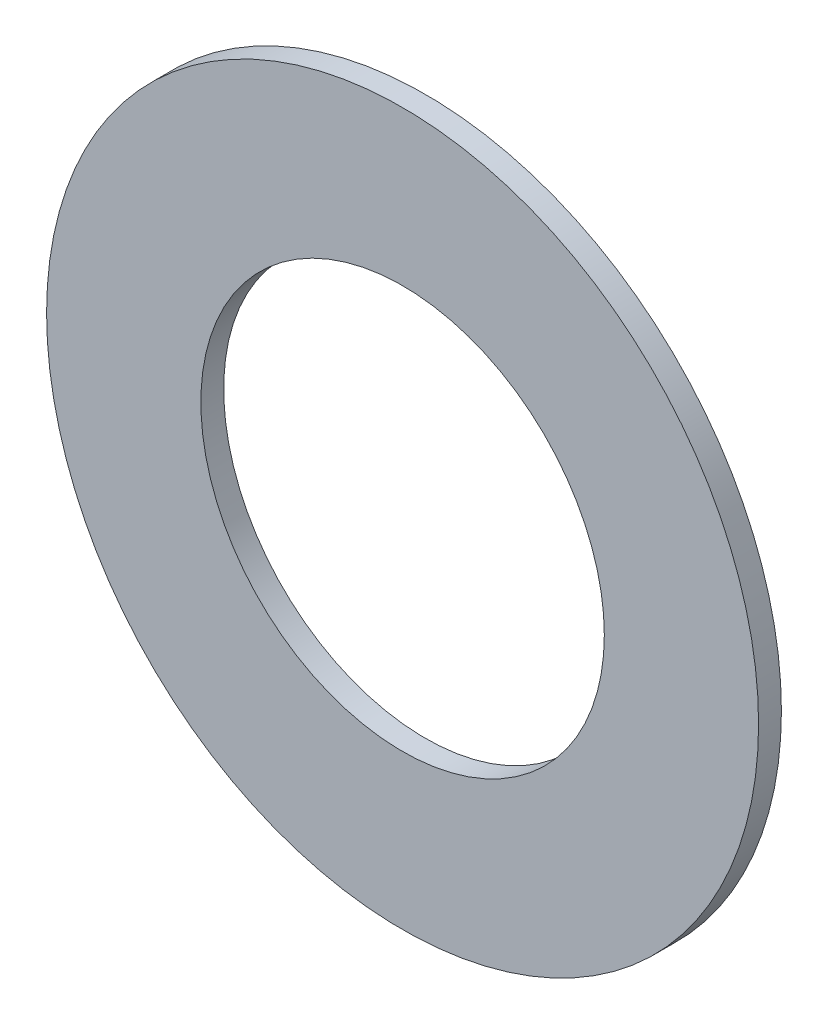
ISO-10303-21;
HEADER;
FILE_DESCRIPTION(('STEP AP214'),'2;1');
FILE_NAME('part.step','',(''),(''),'','','');
FILE_SCHEMA(('AUTOMOTIVE_DESIGN { 1 0 10303 214 1 1 1 1 }'));
ENDSEC;
DATA;
#1=APPLICATION_CONTEXT('core data for automotive mechanical design processes');
#2=APPLICATION_PROTOCOL_DEFINITION('international standard','automotive_design',2000,#1);
#3=PRODUCT_CONTEXT('',#1,'mechanical');
#4=PRODUCT('Part','Part','',(#3));
#5=PRODUCT_RELATED_PRODUCT_CATEGORY('part','',(#4));
#6=PRODUCT_DEFINITION_FORMATION('','',#4);
#7=PRODUCT_DEFINITION_CONTEXT('part definition',#1,'design');
#8=PRODUCT_DEFINITION('design','',#6,#7);
#9=PRODUCT_DEFINITION_SHAPE('','',#8);
#10=(LENGTH_UNIT() NAMED_UNIT(*) SI_UNIT(.MILLI.,.METRE.));
#11=(NAMED_UNIT(*) PLANE_ANGLE_UNIT() SI_UNIT($,.RADIAN.));
#12=(NAMED_UNIT(*) SI_UNIT($,.STERADIAN.) SOLID_ANGLE_UNIT());
#13=UNCERTAINTY_MEASURE_WITH_UNIT(LENGTH_MEASURE(1.E-05),#10,'distance_accuracy_value','');
#14=(GEOMETRIC_REPRESENTATION_CONTEXT(3) GLOBAL_UNCERTAINTY_ASSIGNED_CONTEXT((#13)) GLOBAL_UNIT_ASSIGNED_CONTEXT((#10,
#11,#12)) REPRESENTATION_CONTEXT('',''));
#15=CARTESIAN_POINT('',(0.,0.,0.));
#16=DIRECTION('',(0.,0.,1.));
#17=DIRECTION('',(1.,0.,0.));
#18=AXIS2_PLACEMENT_3D('',#15,#16,#17);
#19=CARTESIAN_POINT('',(0.,0.,3.175));
#20=DIRECTION('',(0.,0.,1.));
#21=DIRECTION('',(1.,0.,0.));
#22=AXIS2_PLACEMENT_3D('',#19,#20,#21);
#23=PLANE('',#22);
#24=CARTESIAN_POINT('',(0.,0.,3.175));
#25=DIRECTION('',(0.,0.,1.));
#26=DIRECTION('',(1.,0.,0.));
#27=AXIS2_PLACEMENT_3D('',#24,#25,#26);
#28=CIRCLE('',#27,49.53);
#29=CARTESIAN_POINT('',(49.53,0.,3.175));
#30=VERTEX_POINT('',#29);
#31=EDGE_CURVE('E10',#30,#30,#28,.T.);
#32=ORIENTED_EDGE('',*,*,#31,.T.);
#33=EDGE_LOOP('',(#32));
#34=FACE_BOUND('',#33,.T.);
#35=CARTESIAN_POINT('',(0.,0.,3.175));
#36=DIRECTION('',(0.,0.,1.));
#37=DIRECTION('',(1.,0.,0.));
#38=AXIS2_PLACEMENT_3D('',#35,#36,#37);
#39=CIRCLE('',#38,28.067);
#40=CARTESIAN_POINT('',(28.067,0.,3.175));
#41=VERTEX_POINT('',#40);
#42=EDGE_CURVE('E42',#41,#41,#39,.T.);
#43=ORIENTED_EDGE('',*,*,#42,.F.);
#44=EDGE_LOOP('',(#43));
#45=FACE_BOUND('',#44,.T.);
#46=ADVANCED_FACE('F31',(#34,#45),#23,.T.);
#47=CARTESIAN_POINT('',(0.,0.,0.));
#48=DIRECTION('',(0.,0.,1.));
#49=DIRECTION('',(1.,0.,0.));
#50=AXIS2_PLACEMENT_3D('',#47,#48,#49);
#51=PLANE('',#50);
#52=CARTESIAN_POINT('',(0.,0.,0.));
#53=DIRECTION('',(0.,0.,1.));
#54=DIRECTION('',(1.,0.,0.));
#55=AXIS2_PLACEMENT_3D('',#52,#53,#54);
#56=CIRCLE('',#55,49.53);
#57=CARTESIAN_POINT('',(49.53,0.,0.));
#58=VERTEX_POINT('',#57);
#59=EDGE_CURVE('E35',#58,#58,#56,.T.);
#60=ORIENTED_EDGE('',*,*,#59,.F.);
#61=EDGE_LOOP('',(#60));
#62=FACE_BOUND('',#61,.T.);
#63=CARTESIAN_POINT('',(0.,0.,0.));
#64=DIRECTION('',(0.,0.,1.));
#65=DIRECTION('',(1.,0.,0.));
#66=AXIS2_PLACEMENT_3D('',#63,#64,#65);
#67=CIRCLE('',#66,28.067);
#68=CARTESIAN_POINT('',(28.067,0.,0.));
#69=VERTEX_POINT('',#68);
#70=EDGE_CURVE('E44',#69,#69,#67,.T.);
#71=ORIENTED_EDGE('',*,*,#70,.T.);
#72=EDGE_LOOP('',(#71));
#73=FACE_BOUND('',#72,.T.);
#74=ADVANCED_FACE('F54',(#62,#73),#51,.F.);
#75=CARTESIAN_POINT('',(0.,0.,3.175));
#76=DIRECTION('',(0.,0.,-1.));
#77=DIRECTION('',(-1.,0.,0.));
#78=AXIS2_PLACEMENT_3D('',#75,#76,#77);
#79=CYLINDRICAL_SURFACE('',#78,49.53);
#80=ORIENTED_EDGE('',*,*,#31,.F.);
#81=EDGE_LOOP('',(#80));
#82=FACE_BOUND('',#81,.T.);
#83=ORIENTED_EDGE('',*,*,#59,.T.);
#84=EDGE_LOOP('',(#83));
#85=FACE_BOUND('',#84,.T.);
#86=ADVANCED_FACE('F33',(#82,#85),#79,.T.);
#87=CARTESIAN_POINT('',(0.,0.,3.175));
#88=DIRECTION('',(0.,0.,-1.));
#89=DIRECTION('',(-1.,0.,0.));
#90=AXIS2_PLACEMENT_3D('',#87,#88,#89);
#91=CYLINDRICAL_SURFACE('',#90,28.067);
#92=ORIENTED_EDGE('',*,*,#42,.T.);
#93=EDGE_LOOP('',(#92));
#94=FACE_BOUND('',#93,.T.);
#95=ORIENTED_EDGE('',*,*,#70,.F.);
#96=EDGE_LOOP('',(#95));
#97=FACE_BOUND('',#96,.T.);
#98=ADVANCED_FACE('F50',(#94,#97),#91,.F.);
#99=CLOSED_SHELL('',(#46,#74,#86,#98));
#100=MANIFOLD_SOLID_BREP('B2',#99);
#101=ADVANCED_BREP_SHAPE_REPRESENTATION('',(#18,#100),#14);
#102=SHAPE_DEFINITION_REPRESENTATION(#9,#101);
ENDSEC;
END-ISO-10303-21;
